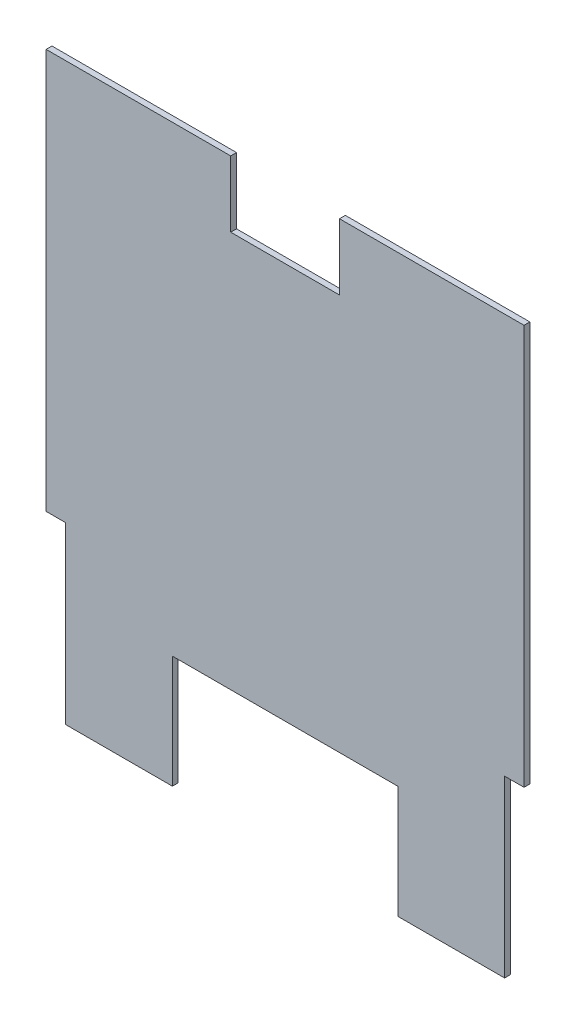
ISO-10303-21;
HEADER;
FILE_DESCRIPTION(('STEP AP214'),'2;1');
FILE_NAME('part.step','',(''),(''),'','','');
FILE_SCHEMA(('AUTOMOTIVE_DESIGN { 1 0 10303 214 1 1 1 1 }'));
ENDSEC;
DATA;
#1=APPLICATION_CONTEXT('core data for automotive mechanical design processes');
#2=APPLICATION_PROTOCOL_DEFINITION('international standard','automotive_design',2000,#1);
#3=PRODUCT_CONTEXT('',#1,'mechanical');
#4=PRODUCT('Part','Part','',(#3));
#5=PRODUCT_RELATED_PRODUCT_CATEGORY('part','',(#4));
#6=PRODUCT_DEFINITION_FORMATION('','',#4);
#7=PRODUCT_DEFINITION_CONTEXT('part definition',#1,'design');
#8=PRODUCT_DEFINITION('design','',#6,#7);
#9=PRODUCT_DEFINITION_SHAPE('','',#8);
#10=(LENGTH_UNIT() NAMED_UNIT(*) SI_UNIT(.MILLI.,.METRE.));
#11=(NAMED_UNIT(*) PLANE_ANGLE_UNIT() SI_UNIT($,.RADIAN.));
#12=(NAMED_UNIT(*) SI_UNIT($,.STERADIAN.) SOLID_ANGLE_UNIT());
#13=UNCERTAINTY_MEASURE_WITH_UNIT(LENGTH_MEASURE(1.E-05),#10,'distance_accuracy_value','');
#14=(GEOMETRIC_REPRESENTATION_CONTEXT(3) GLOBAL_UNCERTAINTY_ASSIGNED_CONTEXT((#13)) GLOBAL_UNIT_ASSIGNED_CONTEXT((#10,
#11,#12)) REPRESENTATION_CONTEXT('',''));
#15=CARTESIAN_POINT('',(0.,0.,0.));
#16=DIRECTION('',(0.,0.,1.));
#17=DIRECTION('',(1.,0.,0.));
#18=AXIS2_PLACEMENT_3D('',#15,#16,#17);
#19=CARTESIAN_POINT('',(-44.45,234.95,4.7625));
#20=DIRECTION('',(0.,-1.,0.));
#21=DIRECTION('',(1.,0.,0.));
#22=AXIS2_PLACEMENT_3D('',#19,#20,#21);
#23=PLANE('',#22);
#24=DIRECTION('',(-1.,0.,0.));
#25=VECTOR('',#24,1.);
#26=CARTESIAN_POINT('',(-44.45,234.95,0.));
#27=LINE('',#26,#25);
#28=CARTESIAN_POINT('',(-44.45,234.95,0.));
#29=VERTEX_POINT('',#28);
#30=CARTESIAN_POINT('',(-195.2625,234.95,0.));
#31=VERTEX_POINT('',#30);
#32=EDGE_CURVE('E176',#29,#31,#27,.T.);
#33=ORIENTED_EDGE('',*,*,#32,.T.);
#34=DIRECTION('',(0.,0.,-1.));
#35=VECTOR('',#34,1.);
#36=CARTESIAN_POINT('',(-195.2625,234.95,4.7625));
#37=LINE('',#36,#35);
#38=CARTESIAN_POINT('',(-195.2625,234.95,4.7625));
#39=VERTEX_POINT('',#38);
#40=EDGE_CURVE('E11',#39,#31,#37,.T.);
#41=ORIENTED_EDGE('',*,*,#40,.F.);
#42=DIRECTION('',(-1.,0.,0.));
#43=VECTOR('',#42,1.);
#44=CARTESIAN_POINT('',(-44.45,234.95,4.7625));
#45=LINE('',#44,#43);
#46=CARTESIAN_POINT('',(-44.45,234.95,4.7625));
#47=VERTEX_POINT('',#46);
#48=EDGE_CURVE('E206',#47,#39,#45,.T.);
#49=ORIENTED_EDGE('',*,*,#48,.F.);
#50=DIRECTION('',(0.,0.,-1.));
#51=VECTOR('',#50,1.);
#52=CARTESIAN_POINT('',(-44.45,234.95,4.7625));
#53=LINE('',#52,#51);
#54=EDGE_CURVE('E172',#47,#29,#53,.T.);
#55=ORIENTED_EDGE('',*,*,#54,.T.);
#56=EDGE_LOOP('',(#33,#41,#49,#55));
#57=FACE_BOUND('',#56,.T.);
#58=ADVANCED_FACE('F32',(#57),#23,.F.);
#59=CARTESIAN_POINT('',(-195.2625,-92.075,4.7625));
#60=DIRECTION('',(1.,0.,0.));
#61=DIRECTION('',(0.,0.,-1.));
#62=AXIS2_PLACEMENT_3D('',#59,#60,#61);
#63=PLANE('',#62);
#64=DIRECTION('',(0.,-1.,0.));
#65=VECTOR('',#64,1.);
#66=CARTESIAN_POINT('',(-195.2625,-92.075,0.));
#67=LINE('',#66,#65);
#68=CARTESIAN_POINT('',(-195.2625,-92.075,0.));
#69=VERTEX_POINT('',#68);
#70=EDGE_CURVE('E179',#31,#69,#67,.T.);
#71=ORIENTED_EDGE('',*,*,#70,.T.);
#72=DIRECTION('',(0.,0.,-1.));
#73=VECTOR('',#72,1.);
#74=CARTESIAN_POINT('',(-195.2625,-92.075,4.7625));
#75=LINE('',#74,#73);
#76=CARTESIAN_POINT('',(-195.2625,-92.075,4.7625));
#77=VERTEX_POINT('',#76);
#78=EDGE_CURVE('E40',#77,#69,#75,.T.);
#79=ORIENTED_EDGE('',*,*,#78,.F.);
#80=DIRECTION('',(0.,-1.,0.));
#81=VECTOR('',#80,1.);
#82=CARTESIAN_POINT('',(-195.2625,-92.075,4.7625));
#83=LINE('',#82,#81);
#84=EDGE_CURVE('E115',#39,#77,#83,.T.);
#85=ORIENTED_EDGE('',*,*,#84,.F.);
#86=ORIENTED_EDGE('',*,*,#40,.T.);
#87=EDGE_LOOP('',(#71,#79,#85,#86));
#88=FACE_BOUND('',#87,.T.);
#89=ADVANCED_FACE('F304',(#88),#63,.F.);
#90=CARTESIAN_POINT('',(-179.3875,-92.075,4.7625));
#91=DIRECTION('',(0.,1.,0.));
#92=DIRECTION('',(-1.,0.,0.));
#93=AXIS2_PLACEMENT_3D('',#90,#91,#92);
#94=PLANE('',#93);
#95=DIRECTION('',(1.,0.,0.));
#96=VECTOR('',#95,1.);
#97=CARTESIAN_POINT('',(-179.3875,-92.075,0.));
#98=LINE('',#97,#96);
#99=CARTESIAN_POINT('',(-179.3875,-92.075,0.));
#100=VERTEX_POINT('',#99);
#101=EDGE_CURVE('E181',#69,#100,#98,.T.);
#102=ORIENTED_EDGE('',*,*,#101,.T.);
#103=DIRECTION('',(0.,0.,-1.));
#104=VECTOR('',#103,1.);
#105=CARTESIAN_POINT('',(-179.3875,-92.075,4.7625));
#106=LINE('',#105,#104);
#107=CARTESIAN_POINT('',(-179.3875,-92.075,4.7625));
#108=VERTEX_POINT('',#107);
#109=EDGE_CURVE('E237',#108,#100,#106,.T.);
#110=ORIENTED_EDGE('',*,*,#109,.F.);
#111=DIRECTION('',(1.,0.,0.));
#112=VECTOR('',#111,1.);
#113=CARTESIAN_POINT('',(-179.3875,-92.075,4.7625));
#114=LINE('',#113,#112);
#115=EDGE_CURVE('E245',#77,#108,#114,.T.);
#116=ORIENTED_EDGE('',*,*,#115,.F.);
#117=ORIENTED_EDGE('',*,*,#78,.T.);
#118=EDGE_LOOP('',(#102,#110,#116,#117));
#119=FACE_BOUND('',#118,.T.);
#120=ADVANCED_FACE('F243',(#119),#94,.F.);
#121=CARTESIAN_POINT('',(-179.3875,-234.95,4.7625));
#122=DIRECTION('',(1.,0.,0.));
#123=DIRECTION('',(0.,1.,0.));
#124=AXIS2_PLACEMENT_3D('',#121,#122,#123);
#125=PLANE('',#124);
#126=DIRECTION('',(0.,-1.,0.));
#127=VECTOR('',#126,1.);
#128=CARTESIAN_POINT('',(-179.3875,-234.95,0.));
#129=LINE('',#128,#127);
#130=CARTESIAN_POINT('',(-179.3875,-234.95,0.));
#131=VERTEX_POINT('',#130);
#132=EDGE_CURVE('E183',#100,#131,#129,.T.);
#133=ORIENTED_EDGE('',*,*,#132,.T.);
#134=DIRECTION('',(0.,0.,-1.));
#135=VECTOR('',#134,1.);
#136=CARTESIAN_POINT('',(-179.3875,-234.95,4.7625));
#137=LINE('',#136,#135);
#138=CARTESIAN_POINT('',(-179.3875,-234.95,4.7625));
#139=VERTEX_POINT('',#138);
#140=EDGE_CURVE('E234',#139,#131,#137,.T.);
#141=ORIENTED_EDGE('',*,*,#140,.F.);
#142=DIRECTION('',(0.,-1.,0.));
#143=VECTOR('',#142,1.);
#144=CARTESIAN_POINT('',(-179.3875,-234.95,4.7625));
#145=LINE('',#144,#143);
#146=EDGE_CURVE('E263',#108,#139,#145,.T.);
#147=ORIENTED_EDGE('',*,*,#146,.F.);
#148=ORIENTED_EDGE('',*,*,#109,.T.);
#149=EDGE_LOOP('',(#133,#141,#147,#148));
#150=FACE_BOUND('',#149,.T.);
#151=ADVANCED_FACE('F254',(#150),#125,.F.);
#152=CARTESIAN_POINT('',(-92.075,-234.95,4.7625));
#153=DIRECTION('',(0.,1.,0.));
#154=DIRECTION('',(-1.,0.,0.));
#155=AXIS2_PLACEMENT_3D('',#152,#153,#154);
#156=PLANE('',#155);
#157=DIRECTION('',(1.,0.,0.));
#158=VECTOR('',#157,1.);
#159=CARTESIAN_POINT('',(-92.075,-234.95,0.));
#160=LINE('',#159,#158);
#161=CARTESIAN_POINT('',(-92.075,-234.95,0.));
#162=VERTEX_POINT('',#161);
#163=EDGE_CURVE('E185',#131,#162,#160,.T.);
#164=ORIENTED_EDGE('',*,*,#163,.T.);
#165=DIRECTION('',(0.,0.,-1.));
#166=VECTOR('',#165,1.);
#167=CARTESIAN_POINT('',(-92.075,-234.95,4.7625));
#168=LINE('',#167,#166);
#169=CARTESIAN_POINT('',(-92.075,-234.95,4.7625));
#170=VERTEX_POINT('',#169);
#171=EDGE_CURVE('E231',#170,#162,#168,.T.);
#172=ORIENTED_EDGE('',*,*,#171,.F.);
#173=DIRECTION('',(1.,0.,0.));
#174=VECTOR('',#173,1.);
#175=CARTESIAN_POINT('',(-92.075,-234.95,4.7625));
#176=LINE('',#175,#174);
#177=EDGE_CURVE('E260',#139,#170,#176,.T.);
#178=ORIENTED_EDGE('',*,*,#177,.F.);
#179=ORIENTED_EDGE('',*,*,#140,.T.);
#180=EDGE_LOOP('',(#164,#172,#178,#179));
#181=FACE_BOUND('',#180,.T.);
#182=ADVANCED_FACE('F258',(#181),#156,.F.);
#183=CARTESIAN_POINT('',(-92.075,-234.95,4.7625));
#184=DIRECTION('',(-1.,0.,0.));
#185=DIRECTION('',(0.,0.,1.));
#186=AXIS2_PLACEMENT_3D('',#183,#184,#185);
#187=PLANE('',#186);
#188=DIRECTION('',(0.,1.,0.));
#189=VECTOR('',#188,1.);
#190=CARTESIAN_POINT('',(-92.075,-234.95,0.));
#191=LINE('',#190,#189);
#192=CARTESIAN_POINT('',(-92.075,-142.875,0.));
#193=VERTEX_POINT('',#192);
#194=EDGE_CURVE('E187',#162,#193,#191,.T.);
#195=ORIENTED_EDGE('',*,*,#194,.T.);
#196=DIRECTION('',(0.,0.,-1.));
#197=VECTOR('',#196,1.);
#198=CARTESIAN_POINT('',(-92.075,-142.875,4.7625));
#199=LINE('',#198,#197);
#200=CARTESIAN_POINT('',(-92.075,-142.875,4.7625));
#201=VERTEX_POINT('',#200);
#202=EDGE_CURVE('E228',#201,#193,#199,.T.);
#203=ORIENTED_EDGE('',*,*,#202,.F.);
#204=DIRECTION('',(0.,1.,0.));
#205=VECTOR('',#204,1.);
#206=CARTESIAN_POINT('',(-92.075,-234.95,4.7625));
#207=LINE('',#206,#205);
#208=EDGE_CURVE('E262',#170,#201,#207,.T.);
#209=ORIENTED_EDGE('',*,*,#208,.F.);
#210=ORIENTED_EDGE('',*,*,#171,.T.);
#211=EDGE_LOOP('',(#195,#203,#209,#210));
#212=FACE_BOUND('',#211,.T.);
#213=ADVANCED_FACE('F317',(#212),#187,.F.);
#214=CARTESIAN_POINT('',(92.075,-142.875,4.7625));
#215=DIRECTION('',(0.,1.,0.));
#216=DIRECTION('',(-1.,0.,0.));
#217=AXIS2_PLACEMENT_3D('',#214,#215,#216);
#218=PLANE('',#217);
#219=DIRECTION('',(1.,0.,0.));
#220=VECTOR('',#219,1.);
#221=CARTESIAN_POINT('',(92.075,-142.875,0.));
#222=LINE('',#221,#220);
#223=CARTESIAN_POINT('',(92.075,-142.875,0.));
#224=VERTEX_POINT('',#223);
#225=EDGE_CURVE('E189',#193,#224,#222,.T.);
#226=ORIENTED_EDGE('',*,*,#225,.T.);
#227=DIRECTION('',(0.,0.,-1.));
#228=VECTOR('',#227,1.);
#229=CARTESIAN_POINT('',(92.075,-142.875,4.7625));
#230=LINE('',#229,#228);
#231=CARTESIAN_POINT('',(92.075,-142.875,4.7625));
#232=VERTEX_POINT('',#231);
#233=EDGE_CURVE('E225',#232,#224,#230,.T.);
#234=ORIENTED_EDGE('',*,*,#233,.F.);
#235=DIRECTION('',(1.,0.,0.));
#236=VECTOR('',#235,1.);
#237=CARTESIAN_POINT('',(92.075,-142.875,4.7625));
#238=LINE('',#237,#236);
#239=EDGE_CURVE('E265',#201,#232,#238,.T.);
#240=ORIENTED_EDGE('',*,*,#239,.F.);
#241=ORIENTED_EDGE('',*,*,#202,.T.);
#242=EDGE_LOOP('',(#226,#234,#240,#241));
#243=FACE_BOUND('',#242,.T.);
#244=ADVANCED_FACE('F320',(#243),#218,.F.);
#245=CARTESIAN_POINT('',(92.075,-234.95,4.7625));
#246=DIRECTION('',(1.,0.,0.));
#247=DIRECTION('',(0.,0.,-1.));
#248=AXIS2_PLACEMENT_3D('',#245,#246,#247);
#249=PLANE('',#248);
#250=DIRECTION('',(0.,-1.,0.));
#251=VECTOR('',#250,1.);
#252=CARTESIAN_POINT('',(92.075,-234.95,0.));
#253=LINE('',#252,#251);
#254=CARTESIAN_POINT('',(92.075,-234.95,0.));
#255=VERTEX_POINT('',#254);
#256=EDGE_CURVE('E191',#224,#255,#253,.T.);
#257=ORIENTED_EDGE('',*,*,#256,.T.);
#258=DIRECTION('',(0.,0.,-1.));
#259=VECTOR('',#258,1.);
#260=CARTESIAN_POINT('',(92.075,-234.95,4.7625));
#261=LINE('',#260,#259);
#262=CARTESIAN_POINT('',(92.075,-234.95,4.7625));
#263=VERTEX_POINT('',#262);
#264=EDGE_CURVE('E222',#263,#255,#261,.T.);
#265=ORIENTED_EDGE('',*,*,#264,.F.);
#266=DIRECTION('',(0.,-1.,0.));
#267=VECTOR('',#266,1.);
#268=CARTESIAN_POINT('',(92.075,-234.95,4.7625));
#269=LINE('',#268,#267);
#270=EDGE_CURVE('E271',#232,#263,#269,.T.);
#271=ORIENTED_EDGE('',*,*,#270,.F.);
#272=ORIENTED_EDGE('',*,*,#233,.T.);
#273=EDGE_LOOP('',(#257,#265,#271,#272));
#274=FACE_BOUND('',#273,.T.);
#275=ADVANCED_FACE('F324',(#274),#249,.F.);
#276=CARTESIAN_POINT('',(179.3875,-234.95,4.7625));
#277=DIRECTION('',(0.,1.,0.));
#278=DIRECTION('',(-1.,0.,0.));
#279=AXIS2_PLACEMENT_3D('',#276,#277,#278);
#280=PLANE('',#279);
#281=DIRECTION('',(1.,0.,0.));
#282=VECTOR('',#281,1.);
#283=CARTESIAN_POINT('',(179.3875,-234.95,0.));
#284=LINE('',#283,#282);
#285=CARTESIAN_POINT('',(179.3875,-234.95,0.));
#286=VERTEX_POINT('',#285);
#287=EDGE_CURVE('E193',#255,#286,#284,.T.);
#288=ORIENTED_EDGE('',*,*,#287,.T.);
#289=DIRECTION('',(0.,0.,-1.));
#290=VECTOR('',#289,1.);
#291=CARTESIAN_POINT('',(179.3875,-234.95,4.7625));
#292=LINE('',#291,#290);
#293=CARTESIAN_POINT('',(179.3875,-234.95,4.7625));
#294=VERTEX_POINT('',#293);
#295=EDGE_CURVE('E219',#294,#286,#292,.T.);
#296=ORIENTED_EDGE('',*,*,#295,.F.);
#297=DIRECTION('',(1.,0.,0.));
#298=VECTOR('',#297,1.);
#299=CARTESIAN_POINT('',(179.3875,-234.95,4.7625));
#300=LINE('',#299,#298);
#301=EDGE_CURVE('E273',#263,#294,#300,.T.);
#302=ORIENTED_EDGE('',*,*,#301,.F.);
#303=ORIENTED_EDGE('',*,*,#264,.T.);
#304=EDGE_LOOP('',(#288,#296,#302,#303));
#305=FACE_BOUND('',#304,.T.);
#306=ADVANCED_FACE('F328',(#305),#280,.F.);
#307=CARTESIAN_POINT('',(179.3875,-234.95,4.7625));
#308=DIRECTION('',(-1.,0.,0.));
#309=DIRECTION('',(0.,-1.,0.));
#310=AXIS2_PLACEMENT_3D('',#307,#308,#309);
#311=PLANE('',#310);
#312=DIRECTION('',(0.,1.,0.));
#313=VECTOR('',#312,1.);
#314=CARTESIAN_POINT('',(179.3875,-234.95,0.));
#315=LINE('',#314,#313);
#316=CARTESIAN_POINT('',(179.3875,-92.075,0.));
#317=VERTEX_POINT('',#316);
#318=EDGE_CURVE('E195',#286,#317,#315,.T.);
#319=ORIENTED_EDGE('',*,*,#318,.T.);
#320=DIRECTION('',(0.,0.,-1.));
#321=VECTOR('',#320,1.);
#322=CARTESIAN_POINT('',(179.3875,-92.075,4.7625));
#323=LINE('',#322,#321);
#324=CARTESIAN_POINT('',(179.3875,-92.075,4.7625));
#325=VERTEX_POINT('',#324);
#326=EDGE_CURVE('E216',#325,#317,#323,.T.);
#327=ORIENTED_EDGE('',*,*,#326,.F.);
#328=DIRECTION('',(0.,1.,0.));
#329=VECTOR('',#328,1.);
#330=CARTESIAN_POINT('',(179.3875,-234.95,4.7625));
#331=LINE('',#330,#329);
#332=EDGE_CURVE('E275',#294,#325,#331,.T.);
#333=ORIENTED_EDGE('',*,*,#332,.F.);
#334=ORIENTED_EDGE('',*,*,#295,.T.);
#335=EDGE_LOOP('',(#319,#327,#333,#334));
#336=FACE_BOUND('',#335,.T.);
#337=ADVANCED_FACE('F332',(#336),#311,.F.);
#338=CARTESIAN_POINT('',(179.3875,-92.075,4.7625));
#339=DIRECTION('',(0.,1.,0.));
#340=DIRECTION('',(-1.,0.,0.));
#341=AXIS2_PLACEMENT_3D('',#338,#339,#340);
#342=PLANE('',#341);
#343=DIRECTION('',(1.,0.,0.));
#344=VECTOR('',#343,1.);
#345=CARTESIAN_POINT('',(179.3875,-92.075,0.));
#346=LINE('',#345,#344);
#347=CARTESIAN_POINT('',(195.2625,-92.075,0.));
#348=VERTEX_POINT('',#347);
#349=EDGE_CURVE('E197',#317,#348,#346,.T.);
#350=ORIENTED_EDGE('',*,*,#349,.T.);
#351=DIRECTION('',(0.,0.,-1.));
#352=VECTOR('',#351,1.);
#353=CARTESIAN_POINT('',(195.2625,-92.075,4.7625));
#354=LINE('',#353,#352);
#355=CARTESIAN_POINT('',(195.2625,-92.075,4.7625));
#356=VERTEX_POINT('',#355);
#357=EDGE_CURVE('E213',#356,#348,#354,.T.);
#358=ORIENTED_EDGE('',*,*,#357,.F.);
#359=DIRECTION('',(1.,0.,0.));
#360=VECTOR('',#359,1.);
#361=CARTESIAN_POINT('',(179.3875,-92.075,4.7625));
#362=LINE('',#361,#360);
#363=EDGE_CURVE('E277',#325,#356,#362,.T.);
#364=ORIENTED_EDGE('',*,*,#363,.F.);
#365=ORIENTED_EDGE('',*,*,#326,.T.);
#366=EDGE_LOOP('',(#350,#358,#364,#365));
#367=FACE_BOUND('',#366,.T.);
#368=ADVANCED_FACE('F336',(#367),#342,.F.);
#369=CARTESIAN_POINT('',(195.2625,-92.075,4.7625));
#370=DIRECTION('',(-1.,0.,0.));
#371=DIRECTION('',(0.,0.,1.));
#372=AXIS2_PLACEMENT_3D('',#369,#370,#371);
#373=PLANE('',#372);
#374=DIRECTION('',(0.,1.,0.));
#375=VECTOR('',#374,1.);
#376=CARTESIAN_POINT('',(195.2625,-92.075,0.));
#377=LINE('',#376,#375);
#378=CARTESIAN_POINT('',(195.2625,234.95,0.));
#379=VERTEX_POINT('',#378);
#380=EDGE_CURVE('E199',#348,#379,#377,.T.);
#381=ORIENTED_EDGE('',*,*,#380,.T.);
#382=DIRECTION('',(0.,0.,-1.));
#383=VECTOR('',#382,1.);
#384=CARTESIAN_POINT('',(195.2625,234.95,4.7625));
#385=LINE('',#384,#383);
#386=CARTESIAN_POINT('',(195.2625,234.95,4.7625));
#387=VERTEX_POINT('',#386);
#388=EDGE_CURVE('E210',#387,#379,#385,.T.);
#389=ORIENTED_EDGE('',*,*,#388,.F.);
#390=DIRECTION('',(0.,1.,0.));
#391=VECTOR('',#390,1.);
#392=CARTESIAN_POINT('',(195.2625,-92.075,4.7625));
#393=LINE('',#392,#391);
#394=EDGE_CURVE('E279',#356,#387,#393,.T.);
#395=ORIENTED_EDGE('',*,*,#394,.F.);
#396=ORIENTED_EDGE('',*,*,#357,.T.);
#397=EDGE_LOOP('',(#381,#389,#395,#396));
#398=FACE_BOUND('',#397,.T.);
#399=ADVANCED_FACE('F285',(#398),#373,.F.);
#400=CARTESIAN_POINT('',(195.2625,234.95,4.7625));
#401=DIRECTION('',(0.,-1.,0.));
#402=DIRECTION('',(1.,0.,0.));
#403=AXIS2_PLACEMENT_3D('',#400,#401,#402);
#404=PLANE('',#403);
#405=DIRECTION('',(-1.,0.,0.));
#406=VECTOR('',#405,1.);
#407=CARTESIAN_POINT('',(195.2625,234.95,0.));
#408=LINE('',#407,#406);
#409=CARTESIAN_POINT('',(44.45,234.95,0.));
#410=VERTEX_POINT('',#409);
#411=EDGE_CURVE('E201',#379,#410,#408,.T.);
#412=ORIENTED_EDGE('',*,*,#411,.T.);
#413=DIRECTION('',(0.,0.,-1.));
#414=VECTOR('',#413,1.);
#415=CARTESIAN_POINT('',(44.45,234.95,4.7625));
#416=LINE('',#415,#414);
#417=CARTESIAN_POINT('',(44.45,234.95,4.7625));
#418=VERTEX_POINT('',#417);
#419=EDGE_CURVE('E167',#418,#410,#416,.T.);
#420=ORIENTED_EDGE('',*,*,#419,.F.);
#421=DIRECTION('',(-1.,0.,0.));
#422=VECTOR('',#421,1.);
#423=CARTESIAN_POINT('',(195.2625,234.95,4.7625));
#424=LINE('',#423,#422);
#425=EDGE_CURVE('E158',#387,#418,#424,.T.);
#426=ORIENTED_EDGE('',*,*,#425,.F.);
#427=ORIENTED_EDGE('',*,*,#388,.T.);
#428=EDGE_LOOP('',(#412,#420,#426,#427));
#429=FACE_BOUND('',#428,.T.);
#430=ADVANCED_FACE('F289',(#429),#404,.F.);
#431=CARTESIAN_POINT('',(44.45,180.975,4.7625));
#432=DIRECTION('',(1.,0.,0.));
#433=DIRECTION('',(0.,1.,0.));
#434=AXIS2_PLACEMENT_3D('',#431,#432,#433);
#435=PLANE('',#434);
#436=DIRECTION('',(0.,-1.,0.));
#437=VECTOR('',#436,1.);
#438=CARTESIAN_POINT('',(44.45,180.975,0.));
#439=LINE('',#438,#437);
#440=CARTESIAN_POINT('',(44.45,180.975,0.));
#441=VERTEX_POINT('',#440);
#442=EDGE_CURVE('E166',#410,#441,#439,.T.);
#443=ORIENTED_EDGE('',*,*,#442,.T.);
#444=DIRECTION('',(0.,0.,-1.));
#445=VECTOR('',#444,1.);
#446=CARTESIAN_POINT('',(44.45,180.975,4.7625));
#447=LINE('',#446,#445);
#448=CARTESIAN_POINT('',(44.45,180.975,4.7625));
#449=VERTEX_POINT('',#448);
#450=EDGE_CURVE('E163',#449,#441,#447,.T.);
#451=ORIENTED_EDGE('',*,*,#450,.F.);
#452=DIRECTION('',(0.,-1.,0.));
#453=VECTOR('',#452,1.);
#454=CARTESIAN_POINT('',(44.45,180.975,4.7625));
#455=LINE('',#454,#453);
#456=EDGE_CURVE('E152',#418,#449,#455,.T.);
#457=ORIENTED_EDGE('',*,*,#456,.F.);
#458=ORIENTED_EDGE('',*,*,#419,.T.);
#459=EDGE_LOOP('',(#443,#451,#457,#458));
#460=FACE_BOUND('',#459,.T.);
#461=ADVANCED_FACE('F164',(#460),#435,.F.);
#462=CARTESIAN_POINT('',(44.45,180.975,4.7625));
#463=DIRECTION('',(0.,-1.,0.));
#464=DIRECTION('',(1.,0.,0.));
#465=AXIS2_PLACEMENT_3D('',#462,#463,#464);
#466=PLANE('',#465);
#467=DIRECTION('',(-1.,0.,0.));
#468=VECTOR('',#467,1.);
#469=CARTESIAN_POINT('',(44.45,180.975,0.));
#470=LINE('',#469,#468);
#471=CARTESIAN_POINT('',(-44.45,180.975,0.));
#472=VERTEX_POINT('',#471);
#473=EDGE_CURVE('E101',#441,#472,#470,.T.);
#474=ORIENTED_EDGE('',*,*,#473,.T.);
#475=DIRECTION('',(0.,0.,-1.));
#476=VECTOR('',#475,1.);
#477=CARTESIAN_POINT('',(-44.45,180.975,4.7625));
#478=LINE('',#477,#476);
#479=CARTESIAN_POINT('',(-44.45,180.975,4.7625));
#480=VERTEX_POINT('',#479);
#481=EDGE_CURVE('E168',#480,#472,#478,.T.);
#482=ORIENTED_EDGE('',*,*,#481,.F.);
#483=DIRECTION('',(-1.,0.,0.));
#484=VECTOR('',#483,1.);
#485=CARTESIAN_POINT('',(44.45,180.975,4.7625));
#486=LINE('',#485,#484);
#487=EDGE_CURVE('E156',#449,#480,#486,.T.);
#488=ORIENTED_EDGE('',*,*,#487,.F.);
#489=ORIENTED_EDGE('',*,*,#450,.T.);
#490=EDGE_LOOP('',(#474,#482,#488,#489));
#491=FACE_BOUND('',#490,.T.);
#492=ADVANCED_FACE('F170',(#491),#466,.F.);
#493=CARTESIAN_POINT('',(-44.45,180.975,4.7625));
#494=DIRECTION('',(-1.,0.,0.));
#495=DIRECTION('',(0.,0.,1.));
#496=AXIS2_PLACEMENT_3D('',#493,#494,#495);
#497=PLANE('',#496);
#498=DIRECTION('',(0.,1.,0.));
#499=VECTOR('',#498,1.);
#500=CARTESIAN_POINT('',(-44.45,180.975,0.));
#501=LINE('',#500,#499);
#502=EDGE_CURVE('E107',#472,#29,#501,.T.);
#503=ORIENTED_EDGE('',*,*,#502,.T.);
#504=ORIENTED_EDGE('',*,*,#54,.F.);
#505=DIRECTION('',(0.,1.,0.));
#506=VECTOR('',#505,1.);
#507=CARTESIAN_POINT('',(-44.45,180.975,4.7625));
#508=LINE('',#507,#506);
#509=EDGE_CURVE('E48',#480,#47,#508,.T.);
#510=ORIENTED_EDGE('',*,*,#509,.F.);
#511=ORIENTED_EDGE('',*,*,#481,.T.);
#512=EDGE_LOOP('',(#503,#504,#510,#511));
#513=FACE_BOUND('',#512,.T.);
#514=ADVANCED_FACE('F293',(#513),#497,.F.);
#515=CARTESIAN_POINT('',(0.,0.,4.7625));
#516=DIRECTION('',(0.,0.,-1.));
#517=DIRECTION('',(-1.,0.,0.));
#518=AXIS2_PLACEMENT_3D('',#515,#516,#517);
#519=PLANE('',#518);
#520=ORIENTED_EDGE('',*,*,#48,.T.);
#521=ORIENTED_EDGE('',*,*,#84,.T.);
#522=ORIENTED_EDGE('',*,*,#115,.T.);
#523=ORIENTED_EDGE('',*,*,#146,.T.);
#524=ORIENTED_EDGE('',*,*,#177,.T.);
#525=ORIENTED_EDGE('',*,*,#208,.T.);
#526=ORIENTED_EDGE('',*,*,#239,.T.);
#527=ORIENTED_EDGE('',*,*,#270,.T.);
#528=ORIENTED_EDGE('',*,*,#301,.T.);
#529=ORIENTED_EDGE('',*,*,#332,.T.);
#530=ORIENTED_EDGE('',*,*,#363,.T.);
#531=ORIENTED_EDGE('',*,*,#394,.T.);
#532=ORIENTED_EDGE('',*,*,#425,.T.);
#533=ORIENTED_EDGE('',*,*,#456,.T.);
#534=ORIENTED_EDGE('',*,*,#487,.T.);
#535=ORIENTED_EDGE('',*,*,#509,.T.);
#536=EDGE_LOOP('',(#520,#521,#522,#523,#524,#525,#526,#527,#528,#529,#530,#531,#532,#533,#534,#535));
#537=FACE_BOUND('',#536,.T.);
#538=ADVANCED_FACE('F154',(#537),#519,.F.);
#539=CARTESIAN_POINT('',(0.,0.,0.));
#540=DIRECTION('',(0.,0.,-1.));
#541=DIRECTION('',(-1.,0.,0.));
#542=AXIS2_PLACEMENT_3D('',#539,#540,#541);
#543=PLANE('',#542);
#544=ORIENTED_EDGE('',*,*,#32,.F.);
#545=ORIENTED_EDGE('',*,*,#502,.F.);
#546=ORIENTED_EDGE('',*,*,#473,.F.);
#547=ORIENTED_EDGE('',*,*,#442,.F.);
#548=ORIENTED_EDGE('',*,*,#411,.F.);
#549=ORIENTED_EDGE('',*,*,#380,.F.);
#550=ORIENTED_EDGE('',*,*,#349,.F.);
#551=ORIENTED_EDGE('',*,*,#318,.F.);
#552=ORIENTED_EDGE('',*,*,#287,.F.);
#553=ORIENTED_EDGE('',*,*,#256,.F.);
#554=ORIENTED_EDGE('',*,*,#225,.F.);
#555=ORIENTED_EDGE('',*,*,#194,.F.);
#556=ORIENTED_EDGE('',*,*,#163,.F.);
#557=ORIENTED_EDGE('',*,*,#132,.F.);
#558=ORIENTED_EDGE('',*,*,#101,.F.);
#559=ORIENTED_EDGE('',*,*,#70,.F.);
#560=EDGE_LOOP('',(#544,#545,#546,#547,#548,#549,#550,#551,#552,#553,#554,#555,#556,#557,#558,#559));
#561=FACE_BOUND('',#560,.T.);
#562=ADVANCED_FACE('F249',(#561),#543,.T.);
#563=CLOSED_SHELL('',(#58,#89,#120,#151,#182,#213,#244,#275,#306,#337,#368,#399,#430,#461,#492,
#514,#538,#562));
#564=MANIFOLD_SOLID_BREP('B2',#563);
#565=ADVANCED_BREP_SHAPE_REPRESENTATION('',(#18,#564),#14);
#566=SHAPE_DEFINITION_REPRESENTATION(#9,#565);
ENDSEC;
END-ISO-10303-21;
